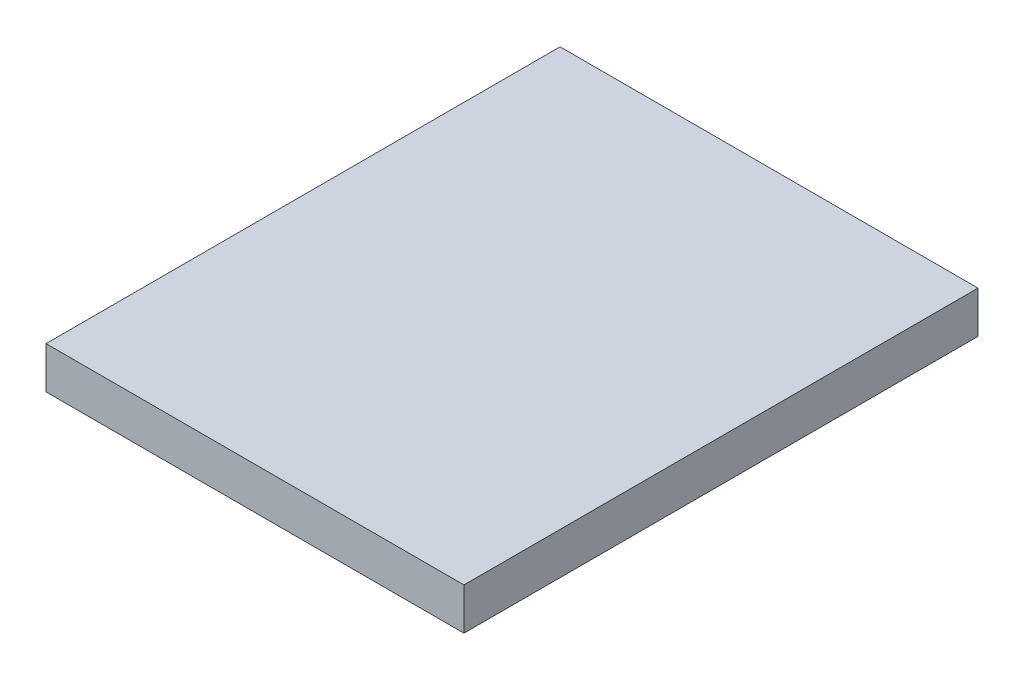
ISO-10303-21;
HEADER;
FILE_DESCRIPTION(('STEP AP214'),'2;1');
FILE_NAME('part.step','',(''),(''),'','','');
FILE_SCHEMA(('AUTOMOTIVE_DESIGN { 1 0 10303 214 1 1 1 1 }'));
ENDSEC;
DATA;
#1=APPLICATION_CONTEXT('core data for automotive mechanical design processes');
#2=APPLICATION_PROTOCOL_DEFINITION('international standard','automotive_design',2000,#1);
#3=PRODUCT_CONTEXT('',#1,'mechanical');
#4=PRODUCT('Part','Part','',(#3));
#5=PRODUCT_RELATED_PRODUCT_CATEGORY('part','',(#4));
#6=PRODUCT_DEFINITION_FORMATION('','',#4);
#7=PRODUCT_DEFINITION_CONTEXT('part definition',#1,'design');
#8=PRODUCT_DEFINITION('design','',#6,#7);
#9=PRODUCT_DEFINITION_SHAPE('','',#8);
#10=(LENGTH_UNIT() NAMED_UNIT(*) SI_UNIT(.MILLI.,.METRE.));
#11=(NAMED_UNIT(*) PLANE_ANGLE_UNIT() SI_UNIT($,.RADIAN.));
#12=(NAMED_UNIT(*) SI_UNIT($,.STERADIAN.) SOLID_ANGLE_UNIT());
#13=UNCERTAINTY_MEASURE_WITH_UNIT(LENGTH_MEASURE(1.E-05),#10,'distance_accuracy_value','');
#14=(GEOMETRIC_REPRESENTATION_CONTEXT(3) GLOBAL_UNCERTAINTY_ASSIGNED_CONTEXT((#13)) GLOBAL_UNIT_ASSIGNED_CONTEXT((#10,
#11,#12)) REPRESENTATION_CONTEXT('',''));
#15=CARTESIAN_POINT('',(0.,0.,0.));
#16=DIRECTION('',(0.,0.,1.));
#17=DIRECTION('',(1.,0.,0.));
#18=AXIS2_PLACEMENT_3D('',#15,#16,#17);
#19=CARTESIAN_POINT('',(0.,1.,0.));
#20=DIRECTION('',(0.,0.,-1.));
#21=DIRECTION('',(-1.,0.,0.));
#22=AXIS2_PLACEMENT_3D('',#19,#20,#21);
#23=PLANE('',#22);
#24=DIRECTION('',(0.,1.,0.));
#25=VECTOR('',#24,1.);
#26=CARTESIAN_POINT('',(130.,1.,0.));
#27=LINE('',#26,#25);
#28=CARTESIAN_POINT('',(130.,0.,0.));
#29=VERTEX_POINT('',#28);
#30=CARTESIAN_POINT('',(130.,1.,0.));
#31=VERTEX_POINT('',#30);
#32=EDGE_CURVE('E93',#29,#31,#27,.T.);
#33=ORIENTED_EDGE('',*,*,#32,.F.);
#34=DIRECTION('',(1.,0.,0.));
#35=VECTOR('',#34,1.);
#36=CARTESIAN_POINT('',(0.,0.,0.));
#37=LINE('',#36,#35);
#38=CARTESIAN_POINT('',(140.,0.,0.));
#39=VERTEX_POINT('',#38);
#40=EDGE_CURVE('E76',#29,#39,#37,.T.);
#41=ORIENTED_EDGE('',*,*,#40,.T.);
#42=DIRECTION('',(0.,-1.,0.));
#43=VECTOR('',#42,1.);
#44=CARTESIAN_POINT('',(140.,1.,0.));
#45=LINE('',#44,#43);
#46=CARTESIAN_POINT('',(140.,1.,0.));
#47=VERTEX_POINT('',#46);
#48=EDGE_CURVE('E11',#47,#39,#45,.T.);
#49=ORIENTED_EDGE('',*,*,#48,.F.);
#50=DIRECTION('',(1.,0.,0.));
#51=VECTOR('',#50,1.);
#52=CARTESIAN_POINT('',(0.,1.,0.));
#53=LINE('',#52,#51);
#54=EDGE_CURVE('E84',#31,#47,#53,.T.);
#55=ORIENTED_EDGE('',*,*,#54,.F.);
#56=EDGE_LOOP('',(#33,#41,#49,#55));
#57=FACE_BOUND('',#56,.T.);
#58=ADVANCED_FACE('F32',(#57),#23,.F.);
#59=CARTESIAN_POINT('',(0.,1.,-12.3));
#60=DIRECTION('',(0.,0.,1.));
#61=DIRECTION('',(1.,0.,0.));
#62=AXIS2_PLACEMENT_3D('',#59,#60,#61);
#63=PLANE('',#62);
#64=DIRECTION('',(0.,-1.,0.));
#65=VECTOR('',#64,1.);
#66=CARTESIAN_POINT('',(130.,1.,-12.3));
#67=LINE('',#66,#65);
#68=CARTESIAN_POINT('',(130.,1.,-12.3));
#69=VERTEX_POINT('',#68);
#70=CARTESIAN_POINT('',(130.,0.,-12.3));
#71=VERTEX_POINT('',#70);
#72=EDGE_CURVE('E46',#69,#71,#67,.T.);
#73=ORIENTED_EDGE('',*,*,#72,.F.);
#74=DIRECTION('',(-1.,0.,0.));
#75=VECTOR('',#74,1.);
#76=CARTESIAN_POINT('',(0.,1.,-12.3));
#77=LINE('',#76,#75);
#78=CARTESIAN_POINT('',(140.,1.,-12.3));
#79=VERTEX_POINT('',#78);
#80=EDGE_CURVE('E81',#79,#69,#77,.T.);
#81=ORIENTED_EDGE('',*,*,#80,.F.);
#82=DIRECTION('',(0.,-1.,0.));
#83=VECTOR('',#82,1.);
#84=CARTESIAN_POINT('',(140.,1.,-12.3));
#85=LINE('',#84,#83);
#86=CARTESIAN_POINT('',(140.,0.,-12.3));
#87=VERTEX_POINT('',#86);
#88=EDGE_CURVE('E39',#79,#87,#85,.T.);
#89=ORIENTED_EDGE('',*,*,#88,.T.);
#90=DIRECTION('',(-1.,0.,0.));
#91=VECTOR('',#90,1.);
#92=CARTESIAN_POINT('',(0.,0.,-12.3));
#93=LINE('',#92,#91);
#94=EDGE_CURVE('E75',#87,#71,#93,.T.);
#95=ORIENTED_EDGE('',*,*,#94,.T.);
#96=EDGE_LOOP('',(#73,#81,#89,#95));
#97=FACE_BOUND('',#96,.T.);
#98=ADVANCED_FACE('F80',(#97),#63,.F.);
#99=CARTESIAN_POINT('',(0.,1.,0.));
#100=DIRECTION('',(0.,-1.,0.));
#101=DIRECTION('',(0.,0.,-1.));
#102=AXIS2_PLACEMENT_3D('',#99,#100,#101);
#103=PLANE('',#102);
#104=DIRECTION('',(0.,0.,-1.));
#105=VECTOR('',#104,1.);
#106=CARTESIAN_POINT('',(130.,1.,-12.3));
#107=LINE('',#106,#105);
#108=EDGE_CURVE('E89',#31,#69,#107,.T.);
#109=ORIENTED_EDGE('',*,*,#108,.F.);
#110=ORIENTED_EDGE('',*,*,#54,.T.);
#111=DIRECTION('',(0.,0.,-1.));
#112=VECTOR('',#111,1.);
#113=CARTESIAN_POINT('',(140.,1.,0.));
#114=LINE('',#113,#112);
#115=EDGE_CURVE('E55',#47,#79,#114,.T.);
#116=ORIENTED_EDGE('',*,*,#115,.T.);
#117=ORIENTED_EDGE('',*,*,#80,.T.);
#118=EDGE_LOOP('',(#109,#110,#116,#117));
#119=FACE_BOUND('',#118,.T.);
#120=ADVANCED_FACE('F106',(#119),#103,.F.);
#121=CARTESIAN_POINT('',(0.,0.,0.));
#122=DIRECTION('',(0.,-1.,0.));
#123=DIRECTION('',(0.,0.,-1.));
#124=AXIS2_PLACEMENT_3D('',#121,#122,#123);
#125=PLANE('',#124);
#126=ORIENTED_EDGE('',*,*,#40,.F.);
#127=DIRECTION('',(0.,0.,1.));
#128=VECTOR('',#127,1.);
#129=CARTESIAN_POINT('',(130.,0.,-12.3));
#130=LINE('',#129,#128);
#131=EDGE_CURVE('E83',#71,#29,#130,.T.);
#132=ORIENTED_EDGE('',*,*,#131,.F.);
#133=ORIENTED_EDGE('',*,*,#94,.F.);
#134=DIRECTION('',(0.,0.,-1.));
#135=VECTOR('',#134,1.);
#136=CARTESIAN_POINT('',(140.,0.,0.));
#137=LINE('',#136,#135);
#138=EDGE_CURVE('E67',#39,#87,#137,.T.);
#139=ORIENTED_EDGE('',*,*,#138,.F.);
#140=EDGE_LOOP('',(#126,#132,#133,#139));
#141=FACE_BOUND('',#140,.T.);
#142=ADVANCED_FACE('F82',(#141),#125,.T.);
#143=CARTESIAN_POINT('',(140.,1.,0.));
#144=DIRECTION('',(-1.,0.,0.));
#145=DIRECTION('',(0.,0.,1.));
#146=AXIS2_PLACEMENT_3D('',#143,#144,#145);
#147=PLANE('',#146);
#148=ORIENTED_EDGE('',*,*,#138,.T.);
#149=ORIENTED_EDGE('',*,*,#88,.F.);
#150=ORIENTED_EDGE('',*,*,#115,.F.);
#151=ORIENTED_EDGE('',*,*,#48,.T.);
#152=EDGE_LOOP('',(#148,#149,#150,#151));
#153=FACE_BOUND('',#152,.T.);
#154=ADVANCED_FACE('F69',(#153),#147,.F.);
#155=CARTESIAN_POINT('',(130.,0.,0.));
#156=DIRECTION('',(-1.,0.,0.));
#157=DIRECTION('',(0.,0.,1.));
#158=AXIS2_PLACEMENT_3D('',#155,#156,#157);
#159=PLANE('',#158);
#160=ORIENTED_EDGE('',*,*,#72,.T.);
#161=ORIENTED_EDGE('',*,*,#131,.T.);
#162=ORIENTED_EDGE('',*,*,#32,.T.);
#163=ORIENTED_EDGE('',*,*,#108,.T.);
#164=EDGE_LOOP('',(#160,#161,#162,#163));
#165=FACE_BOUND('',#164,.T.);
#166=ADVANCED_FACE('F99',(#165),#159,.T.);
#167=CLOSED_SHELL('',(#58,#98,#120,#142,#154,#166));
#168=MANIFOLD_SOLID_BREP('B2',#167);
#169=ADVANCED_BREP_SHAPE_REPRESENTATION('',(#18,#168),#14);
#170=SHAPE_DEFINITION_REPRESENTATION(#9,#169);
ENDSEC;
END-ISO-10303-21;
